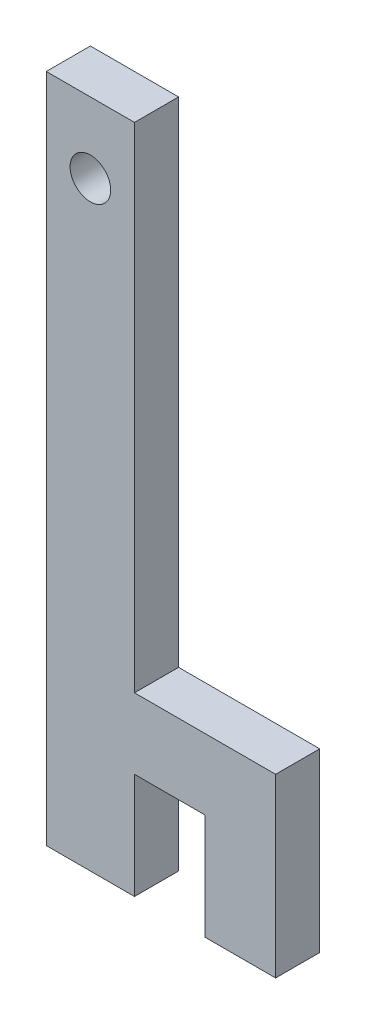
ISO-10303-21;
HEADER;
FILE_DESCRIPTION(('STEP AP214'),'2;1');
FILE_NAME('part.step','',(''),(''),'','','');
FILE_SCHEMA(('AUTOMOTIVE_DESIGN { 1 0 10303 214 1 1 1 1 }'));
ENDSEC;
DATA;
#1=APPLICATION_CONTEXT('core data for automotive mechanical design processes');
#2=APPLICATION_PROTOCOL_DEFINITION('international standard','automotive_design',2000,#1);
#3=PRODUCT_CONTEXT('',#1,'mechanical');
#4=PRODUCT('Part','Part','',(#3));
#5=PRODUCT_RELATED_PRODUCT_CATEGORY('part','',(#4));
#6=PRODUCT_DEFINITION_FORMATION('','',#4);
#7=PRODUCT_DEFINITION_CONTEXT('part definition',#1,'design');
#8=PRODUCT_DEFINITION('design','',#6,#7);
#9=PRODUCT_DEFINITION_SHAPE('','',#8);
#10=(LENGTH_UNIT() NAMED_UNIT(*) SI_UNIT(.MILLI.,.METRE.));
#11=(NAMED_UNIT(*) PLANE_ANGLE_UNIT() SI_UNIT($,.RADIAN.));
#12=(NAMED_UNIT(*) SI_UNIT($,.STERADIAN.) SOLID_ANGLE_UNIT());
#13=UNCERTAINTY_MEASURE_WITH_UNIT(LENGTH_MEASURE(1.E-05),#10,'distance_accuracy_value','');
#14=(GEOMETRIC_REPRESENTATION_CONTEXT(3) GLOBAL_UNCERTAINTY_ASSIGNED_CONTEXT((#13)) GLOBAL_UNIT_ASSIGNED_CONTEXT((#10,
#11,#12)) REPRESENTATION_CONTEXT('',''));
#15=CARTESIAN_POINT('',(0.,0.,0.));
#16=DIRECTION('',(0.,0.,1.));
#17=DIRECTION('',(1.,0.,0.));
#18=AXIS2_PLACEMENT_3D('',#15,#16,#17);
#19=CARTESIAN_POINT('',(6.35,0.,3.175));
#20=DIRECTION('',(-1.,0.,0.));
#21=DIRECTION('',(0.,0.,1.));
#22=AXIS2_PLACEMENT_3D('',#19,#20,#21);
#23=PLANE('',#22);
#24=DIRECTION('',(0.,0.,-1.));
#25=VECTOR('',#24,1.);
#26=CARTESIAN_POINT('',(6.35,7.62,3.175));
#27=LINE('',#26,#25);
#28=CARTESIAN_POINT('',(6.35,7.62,3.175));
#29=VERTEX_POINT('',#28);
#30=CARTESIAN_POINT('',(6.35,7.62,0.));
#31=VERTEX_POINT('',#30);
#32=EDGE_CURVE('E202',#29,#31,#27,.T.);
#33=ORIENTED_EDGE('',*,*,#32,.F.);
#34=DIRECTION('',(0.,1.,0.));
#35=VECTOR('',#34,1.);
#36=CARTESIAN_POINT('',(6.35,0.,3.175));
#37=LINE('',#36,#35);
#38=CARTESIAN_POINT('',(6.35,0.,3.175));
#39=VERTEX_POINT('',#38);
#40=EDGE_CURVE('E111',#39,#29,#37,.T.);
#41=ORIENTED_EDGE('',*,*,#40,.F.);
#42=DIRECTION('',(0.,0.,-1.));
#43=VECTOR('',#42,1.);
#44=CARTESIAN_POINT('',(6.35,0.,3.175));
#45=LINE('',#44,#43);
#46=CARTESIAN_POINT('',(6.35,0.,0.));
#47=VERTEX_POINT('',#46);
#48=EDGE_CURVE('E12',#39,#47,#45,.T.);
#49=ORIENTED_EDGE('',*,*,#48,.T.);
#50=DIRECTION('',(0.,1.,0.));
#51=VECTOR('',#50,1.);
#52=CARTESIAN_POINT('',(6.35,0.,0.));
#53=LINE('',#52,#51);
#54=EDGE_CURVE('E183',#47,#31,#53,.T.);
#55=ORIENTED_EDGE('',*,*,#54,.T.);
#56=EDGE_LOOP('',(#33,#41,#49,#55));
#57=FACE_BOUND('',#56,.T.);
#58=ADVANCED_FACE('F61',(#57),#23,.F.);
#59=CARTESIAN_POINT('',(0.,0.,0.));
#60=DIRECTION('',(0.,0.,1.));
#61=DIRECTION('',(1.,0.,0.));
#62=AXIS2_PLACEMENT_3D('',#59,#60,#61);
#63=PLANE('',#62);
#64=CARTESIAN_POINT('',(3.175,43.18,0.));
#65=DIRECTION('',(0.,0.,1.));
#66=DIRECTION('',(1.,0.,0.));
#67=AXIS2_PLACEMENT_3D('',#64,#65,#66);
#68=CIRCLE('',#67,1.4605);
#69=CARTESIAN_POINT('',(4.6355,43.18,0.));
#70=VERTEX_POINT('',#69);
#71=EDGE_CURVE('E182',#70,#70,#68,.T.);
#72=ORIENTED_EDGE('',*,*,#71,.T.);
#73=EDGE_LOOP('',(#72));
#74=FACE_BOUND('',#73,.T.);
#75=DIRECTION('',(1.,0.,0.));
#76=VECTOR('',#75,1.);
#77=CARTESIAN_POINT('',(0.,0.,0.));
#78=LINE('',#77,#76);
#79=CARTESIAN_POINT('',(0.,0.,0.));
#80=VERTEX_POINT('',#79);
#81=EDGE_CURVE('E179',#80,#47,#78,.T.);
#82=ORIENTED_EDGE('',*,*,#81,.F.);
#83=DIRECTION('',(0.,1.,0.));
#84=VECTOR('',#83,1.);
#85=CARTESIAN_POINT('',(0.,0.,0.));
#86=LINE('',#85,#84);
#87=CARTESIAN_POINT('',(0.,48.26,0.));
#88=VERTEX_POINT('',#87);
#89=EDGE_CURVE('E172',#80,#88,#86,.T.);
#90=ORIENTED_EDGE('',*,*,#89,.T.);
#91=DIRECTION('',(1.,0.,0.));
#92=VECTOR('',#91,1.);
#93=CARTESIAN_POINT('',(0.,48.26,0.));
#94=LINE('',#93,#92);
#95=CARTESIAN_POINT('',(6.35,48.26,0.));
#96=VERTEX_POINT('',#95);
#97=EDGE_CURVE('E186',#88,#96,#94,.T.);
#98=ORIENTED_EDGE('',*,*,#97,.T.);
#99=CARTESIAN_POINT('',(6.35,12.7,0.));
#100=VERTEX_POINT('',#99);
#101=EDGE_CURVE('E181',#100,#96,#53,.T.);
#102=ORIENTED_EDGE('',*,*,#101,.F.);
#103=DIRECTION('',(1.,0.,0.));
#104=VECTOR('',#103,1.);
#105=CARTESIAN_POINT('',(6.35,12.7,0.));
#106=LINE('',#105,#104);
#107=CARTESIAN_POINT('',(16.51,12.7,0.));
#108=VERTEX_POINT('',#107);
#109=EDGE_CURVE('E76',#100,#108,#106,.T.);
#110=ORIENTED_EDGE('',*,*,#109,.T.);
#111=DIRECTION('',(0.,-1.,0.));
#112=VECTOR('',#111,1.);
#113=CARTESIAN_POINT('',(16.51,12.7,0.));
#114=LINE('',#113,#112);
#115=CARTESIAN_POINT('',(16.51,0.,0.));
#116=VERTEX_POINT('',#115);
#117=EDGE_CURVE('E342',#108,#116,#114,.T.);
#118=ORIENTED_EDGE('',*,*,#117,.T.);
#119=DIRECTION('',(-1.,0.,0.));
#120=VECTOR('',#119,1.);
#121=CARTESIAN_POINT('',(16.51,0.,0.));
#122=LINE('',#121,#120);
#123=CARTESIAN_POINT('',(11.43,0.,0.));
#124=VERTEX_POINT('',#123);
#125=EDGE_CURVE('E211',#116,#124,#122,.T.);
#126=ORIENTED_EDGE('',*,*,#125,.T.);
#127=DIRECTION('',(0.,1.,0.));
#128=VECTOR('',#127,1.);
#129=CARTESIAN_POINT('',(11.43,0.,0.));
#130=LINE('',#129,#128);
#131=CARTESIAN_POINT('',(11.43,7.62,0.));
#132=VERTEX_POINT('',#131);
#133=EDGE_CURVE('E208',#124,#132,#130,.T.);
#134=ORIENTED_EDGE('',*,*,#133,.T.);
#135=DIRECTION('',(-1.,0.,0.));
#136=VECTOR('',#135,1.);
#137=CARTESIAN_POINT('',(11.43,7.62,0.));
#138=LINE('',#137,#136);
#139=EDGE_CURVE('E164',#132,#31,#138,.T.);
#140=ORIENTED_EDGE('',*,*,#139,.T.);
#141=ORIENTED_EDGE('',*,*,#54,.F.);
#142=EDGE_LOOP('',(#82,#90,#98,#102,#110,#118,#126,#134,#140,#141));
#143=FACE_BOUND('',#142,.T.);
#144=ADVANCED_FACE('F197',(#74,#143),#63,.F.);
#145=CARTESIAN_POINT('',(6.35,12.7,3.175));
#146=VERTEX_POINT('',#145);
#147=CARTESIAN_POINT('',(6.35,48.26,3.175));
#148=VERTEX_POINT('',#147);
#149=EDGE_CURVE('E159',#146,#148,#37,.T.);
#150=ORIENTED_EDGE('',*,*,#149,.F.);
#151=DIRECTION('',(0.,0.,-1.));
#152=VECTOR('',#151,1.);
#153=CARTESIAN_POINT('',(6.35,12.7,3.175));
#154=LINE('',#153,#152);
#155=EDGE_CURVE('E145',#146,#100,#154,.T.);
#156=ORIENTED_EDGE('',*,*,#155,.T.);
#157=ORIENTED_EDGE('',*,*,#101,.T.);
#158=DIRECTION('',(0.,0.,-1.));
#159=VECTOR('',#158,1.);
#160=CARTESIAN_POINT('',(6.35,48.26,3.175));
#161=LINE('',#160,#159);
#162=EDGE_CURVE('E69',#148,#96,#161,.T.);
#163=ORIENTED_EDGE('',*,*,#162,.F.);
#164=EDGE_LOOP('',(#150,#156,#157,#163));
#165=FACE_BOUND('',#164,.T.);
#166=ADVANCED_FACE('F166',(#165),#23,.F.);
#167=CARTESIAN_POINT('',(0.,0.,3.175));
#168=DIRECTION('',(0.,1.,0.));
#169=DIRECTION('',(0.,0.,1.));
#170=AXIS2_PLACEMENT_3D('',#167,#168,#169);
#171=PLANE('',#170);
#172=ORIENTED_EDGE('',*,*,#81,.T.);
#173=ORIENTED_EDGE('',*,*,#48,.F.);
#174=DIRECTION('',(1.,0.,0.));
#175=VECTOR('',#174,1.);
#176=CARTESIAN_POINT('',(0.,0.,3.175));
#177=LINE('',#176,#175);
#178=CARTESIAN_POINT('',(0.,0.,3.175));
#179=VERTEX_POINT('',#178);
#180=EDGE_CURVE('E169',#179,#39,#177,.T.);
#181=ORIENTED_EDGE('',*,*,#180,.F.);
#182=DIRECTION('',(0.,0.,-1.));
#183=VECTOR('',#182,1.);
#184=CARTESIAN_POINT('',(0.,0.,3.175));
#185=LINE('',#184,#183);
#186=EDGE_CURVE('E85',#179,#80,#185,.T.);
#187=ORIENTED_EDGE('',*,*,#186,.T.);
#188=EDGE_LOOP('',(#172,#173,#181,#187));
#189=FACE_BOUND('',#188,.T.);
#190=ADVANCED_FACE('F63',(#189),#171,.F.);
#191=CARTESIAN_POINT('',(0.,0.,3.175));
#192=DIRECTION('',(-1.,0.,0.));
#193=DIRECTION('',(0.,0.,1.));
#194=AXIS2_PLACEMENT_3D('',#191,#192,#193);
#195=PLANE('',#194);
#196=ORIENTED_EDGE('',*,*,#89,.F.);
#197=ORIENTED_EDGE('',*,*,#186,.F.);
#198=DIRECTION('',(0.,1.,0.));
#199=VECTOR('',#198,1.);
#200=CARTESIAN_POINT('',(0.,0.,3.175));
#201=LINE('',#200,#199);
#202=CARTESIAN_POINT('',(0.,48.26,3.175));
#203=VERTEX_POINT('',#202);
#204=EDGE_CURVE('E177',#179,#203,#201,.T.);
#205=ORIENTED_EDGE('',*,*,#204,.T.);
#206=DIRECTION('',(0.,0.,-1.));
#207=VECTOR('',#206,1.);
#208=CARTESIAN_POINT('',(0.,48.26,3.175));
#209=LINE('',#208,#207);
#210=EDGE_CURVE('E192',#203,#88,#209,.T.);
#211=ORIENTED_EDGE('',*,*,#210,.T.);
#212=EDGE_LOOP('',(#196,#197,#205,#211));
#213=FACE_BOUND('',#212,.T.);
#214=ADVANCED_FACE('F198',(#213),#195,.T.);
#215=CARTESIAN_POINT('',(0.,48.26,3.175));
#216=DIRECTION('',(0.,1.,0.));
#217=DIRECTION('',(0.,0.,1.));
#218=AXIS2_PLACEMENT_3D('',#215,#216,#217);
#219=PLANE('',#218);
#220=ORIENTED_EDGE('',*,*,#97,.F.);
#221=ORIENTED_EDGE('',*,*,#210,.F.);
#222=DIRECTION('',(1.,0.,0.));
#223=VECTOR('',#222,1.);
#224=CARTESIAN_POINT('',(0.,48.26,3.175));
#225=LINE('',#224,#223);
#226=EDGE_CURVE('E171',#203,#148,#225,.T.);
#227=ORIENTED_EDGE('',*,*,#226,.T.);
#228=ORIENTED_EDGE('',*,*,#162,.T.);
#229=EDGE_LOOP('',(#220,#221,#227,#228));
#230=FACE_BOUND('',#229,.T.);
#231=ADVANCED_FACE('F195',(#230),#219,.T.);
#232=CARTESIAN_POINT('',(0.,0.,3.175));
#233=DIRECTION('',(0.,0.,1.));
#234=DIRECTION('',(1.,0.,0.));
#235=AXIS2_PLACEMENT_3D('',#232,#233,#234);
#236=PLANE('',#235);
#237=CARTESIAN_POINT('',(3.175,43.18,3.175));
#238=DIRECTION('',(0.,0.,1.));
#239=DIRECTION('',(1.,0.,0.));
#240=AXIS2_PLACEMENT_3D('',#237,#238,#239);
#241=CIRCLE('',#240,1.4605);
#242=CARTESIAN_POINT('',(4.6355,43.18,3.175));
#243=VERTEX_POINT('',#242);
#244=EDGE_CURVE('E216',#243,#243,#241,.T.);
#245=ORIENTED_EDGE('',*,*,#244,.F.);
#246=EDGE_LOOP('',(#245));
#247=FACE_BOUND('',#246,.T.);
#248=ORIENTED_EDGE('',*,*,#180,.T.);
#249=ORIENTED_EDGE('',*,*,#40,.T.);
#250=DIRECTION('',(-1.,0.,0.));
#251=VECTOR('',#250,1.);
#252=CARTESIAN_POINT('',(11.43,7.62,3.175));
#253=LINE('',#252,#251);
#254=CARTESIAN_POINT('',(11.43,7.62,3.175));
#255=VERTEX_POINT('',#254);
#256=EDGE_CURVE('E153',#255,#29,#253,.T.);
#257=ORIENTED_EDGE('',*,*,#256,.F.);
#258=DIRECTION('',(0.,1.,0.));
#259=VECTOR('',#258,1.);
#260=CARTESIAN_POINT('',(11.43,0.,3.175));
#261=LINE('',#260,#259);
#262=CARTESIAN_POINT('',(11.43,0.,3.175));
#263=VERTEX_POINT('',#262);
#264=EDGE_CURVE('E352',#263,#255,#261,.T.);
#265=ORIENTED_EDGE('',*,*,#264,.F.);
#266=DIRECTION('',(-1.,0.,0.));
#267=VECTOR('',#266,1.);
#268=CARTESIAN_POINT('',(16.51,0.,3.175));
#269=LINE('',#268,#267);
#270=CARTESIAN_POINT('',(16.51,0.,3.175));
#271=VERTEX_POINT('',#270);
#272=EDGE_CURVE('E349',#271,#263,#269,.T.);
#273=ORIENTED_EDGE('',*,*,#272,.F.);
#274=DIRECTION('',(0.,-1.,0.));
#275=VECTOR('',#274,1.);
#276=CARTESIAN_POINT('',(16.51,12.7,3.175));
#277=LINE('',#276,#275);
#278=CARTESIAN_POINT('',(16.51,12.7,3.175));
#279=VERTEX_POINT('',#278);
#280=EDGE_CURVE('E163',#279,#271,#277,.T.);
#281=ORIENTED_EDGE('',*,*,#280,.F.);
#282=DIRECTION('',(1.,0.,0.));
#283=VECTOR('',#282,1.);
#284=CARTESIAN_POINT('',(6.35,12.7,3.175));
#285=LINE('',#284,#283);
#286=EDGE_CURVE('E148',#146,#279,#285,.T.);
#287=ORIENTED_EDGE('',*,*,#286,.F.);
#288=ORIENTED_EDGE('',*,*,#149,.T.);
#289=ORIENTED_EDGE('',*,*,#226,.F.);
#290=ORIENTED_EDGE('',*,*,#204,.F.);
#291=EDGE_LOOP('',(#248,#249,#257,#265,#273,#281,#287,#288,#289,#290));
#292=FACE_BOUND('',#291,.T.);
#293=ADVANCED_FACE('F157',(#247,#292),#236,.T.);
#294=CARTESIAN_POINT('',(3.175,43.18,0.));
#295=DIRECTION('',(0.,0.,1.));
#296=DIRECTION('',(1.,0.,0.));
#297=AXIS2_PLACEMENT_3D('',#294,#295,#296);
#298=CYLINDRICAL_SURFACE('',#297,1.4605);
#299=ORIENTED_EDGE('',*,*,#71,.F.);
#300=EDGE_LOOP('',(#299));
#301=FACE_BOUND('',#300,.T.);
#302=ORIENTED_EDGE('',*,*,#244,.T.);
#303=EDGE_LOOP('',(#302));
#304=FACE_BOUND('',#303,.T.);
#305=ADVANCED_FACE('F228',(#301,#304),#298,.F.);
#306=CARTESIAN_POINT('',(11.43,7.62,3.175));
#307=DIRECTION('',(0.,-1.,0.));
#308=DIRECTION('',(1.,0.,0.));
#309=AXIS2_PLACEMENT_3D('',#306,#307,#308);
#310=PLANE('',#309);
#311=ORIENTED_EDGE('',*,*,#139,.F.);
#312=DIRECTION('',(0.,0.,-1.));
#313=VECTOR('',#312,1.);
#314=CARTESIAN_POINT('',(11.43,7.62,3.175));
#315=LINE('',#314,#313);
#316=EDGE_CURVE('E217',#255,#132,#315,.T.);
#317=ORIENTED_EDGE('',*,*,#316,.F.);
#318=ORIENTED_EDGE('',*,*,#256,.T.);
#319=ORIENTED_EDGE('',*,*,#32,.T.);
#320=EDGE_LOOP('',(#311,#317,#318,#319));
#321=FACE_BOUND('',#320,.T.);
#322=ADVANCED_FACE('F236',(#321),#310,.T.);
#323=CARTESIAN_POINT('',(11.43,0.,3.175));
#324=DIRECTION('',(-1.,0.,0.));
#325=DIRECTION('',(0.,0.,1.));
#326=AXIS2_PLACEMENT_3D('',#323,#324,#325);
#327=PLANE('',#326);
#328=ORIENTED_EDGE('',*,*,#133,.F.);
#329=DIRECTION('',(0.,0.,-1.));
#330=VECTOR('',#329,1.);
#331=CARTESIAN_POINT('',(11.43,0.,3.175));
#332=LINE('',#331,#330);
#333=EDGE_CURVE('E219',#263,#124,#332,.T.);
#334=ORIENTED_EDGE('',*,*,#333,.F.);
#335=ORIENTED_EDGE('',*,*,#264,.T.);
#336=ORIENTED_EDGE('',*,*,#316,.T.);
#337=EDGE_LOOP('',(#328,#334,#335,#336));
#338=FACE_BOUND('',#337,.T.);
#339=ADVANCED_FACE('F299',(#338),#327,.T.);
#340=CARTESIAN_POINT('',(16.51,0.,3.175));
#341=DIRECTION('',(0.,-1.,0.));
#342=DIRECTION('',(1.,0.,0.));
#343=AXIS2_PLACEMENT_3D('',#340,#341,#342);
#344=PLANE('',#343);
#345=ORIENTED_EDGE('',*,*,#125,.F.);
#346=DIRECTION('',(0.,0.,-1.));
#347=VECTOR('',#346,1.);
#348=CARTESIAN_POINT('',(16.51,0.,3.175));
#349=LINE('',#348,#347);
#350=EDGE_CURVE('E221',#271,#116,#349,.T.);
#351=ORIENTED_EDGE('',*,*,#350,.F.);
#352=ORIENTED_EDGE('',*,*,#272,.T.);
#353=ORIENTED_EDGE('',*,*,#333,.T.);
#354=EDGE_LOOP('',(#345,#351,#352,#353));
#355=FACE_BOUND('',#354,.T.);
#356=ADVANCED_FACE('F308',(#355),#344,.T.);
#357=CARTESIAN_POINT('',(16.51,12.7,3.175));
#358=DIRECTION('',(1.,0.,0.));
#359=DIRECTION('',(0.,0.,-1.));
#360=AXIS2_PLACEMENT_3D('',#357,#358,#359);
#361=PLANE('',#360);
#362=ORIENTED_EDGE('',*,*,#117,.F.);
#363=DIRECTION('',(0.,0.,-1.));
#364=VECTOR('',#363,1.);
#365=CARTESIAN_POINT('',(16.51,12.7,3.175));
#366=LINE('',#365,#364);
#367=EDGE_CURVE('E152',#279,#108,#366,.T.);
#368=ORIENTED_EDGE('',*,*,#367,.F.);
#369=ORIENTED_EDGE('',*,*,#280,.T.);
#370=ORIENTED_EDGE('',*,*,#350,.T.);
#371=EDGE_LOOP('',(#362,#368,#369,#370));
#372=FACE_BOUND('',#371,.T.);
#373=ADVANCED_FACE('F318',(#372),#361,.T.);
#374=CARTESIAN_POINT('',(6.35,12.7,3.175));
#375=DIRECTION('',(0.,1.,0.));
#376=DIRECTION('',(-1.,0.,0.));
#377=AXIS2_PLACEMENT_3D('',#374,#375,#376);
#378=PLANE('',#377);
#379=ORIENTED_EDGE('',*,*,#109,.F.);
#380=ORIENTED_EDGE('',*,*,#155,.F.);
#381=ORIENTED_EDGE('',*,*,#286,.T.);
#382=ORIENTED_EDGE('',*,*,#367,.T.);
#383=EDGE_LOOP('',(#379,#380,#381,#382));
#384=FACE_BOUND('',#383,.T.);
#385=ADVANCED_FACE('F147',(#384),#378,.T.);
#386=CLOSED_SHELL('',(#58,#144,#166,#190,#214,#231,#293,#305,#322,#339,#356,#373,#385));
#387=MANIFOLD_SOLID_BREP('B2',#386);
#388=ADVANCED_BREP_SHAPE_REPRESENTATION('',(#18,#387),#14);
#389=SHAPE_DEFINITION_REPRESENTATION(#9,#388);
ENDSEC;
END-ISO-10303-21;
